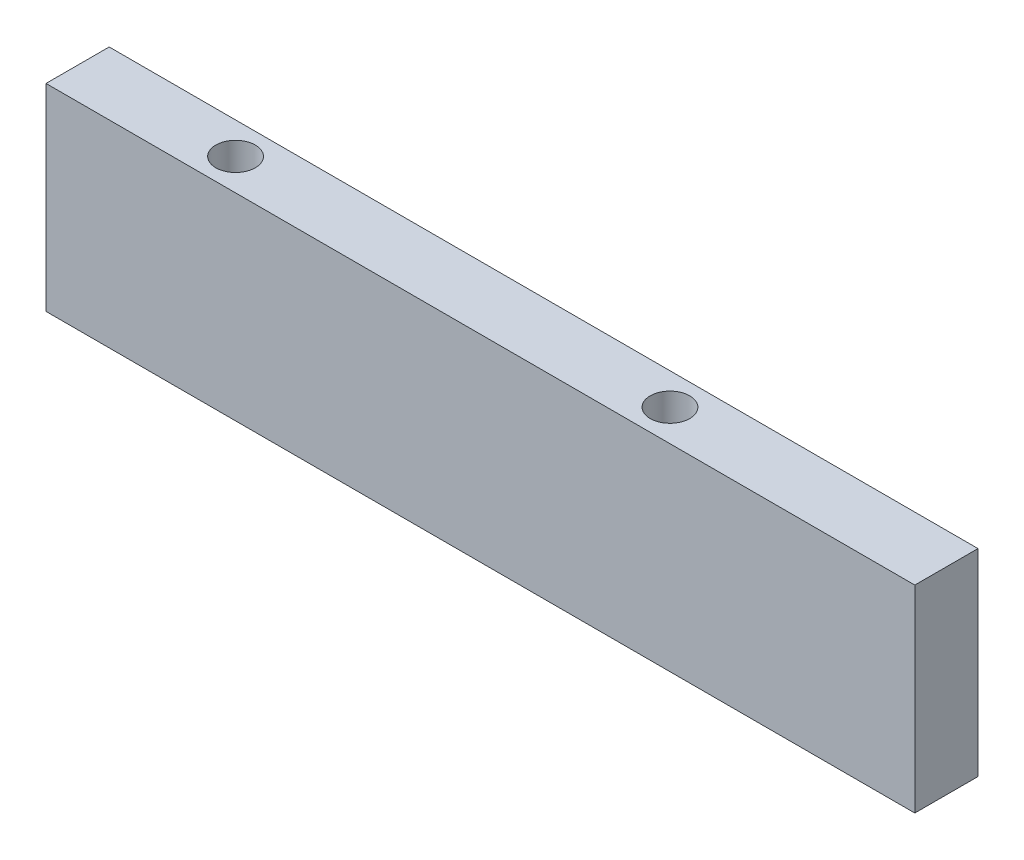
ISO-10303-21;
HEADER;
FILE_DESCRIPTION(('STEP AP214'),'2;1');
FILE_NAME('part.step','',(''),(''),'','','');
FILE_SCHEMA(('AUTOMOTIVE_DESIGN { 1 0 10303 214 1 1 1 1 }'));
ENDSEC;
DATA;
#1=APPLICATION_CONTEXT('core data for automotive mechanical design processes');
#2=APPLICATION_PROTOCOL_DEFINITION('international standard','automotive_design',2000,#1);
#3=PRODUCT_CONTEXT('',#1,'mechanical');
#4=PRODUCT('Part','Part','',(#3));
#5=PRODUCT_RELATED_PRODUCT_CATEGORY('part','',(#4));
#6=PRODUCT_DEFINITION_FORMATION('','',#4);
#7=PRODUCT_DEFINITION_CONTEXT('part definition',#1,'design');
#8=PRODUCT_DEFINITION('design','',#6,#7);
#9=PRODUCT_DEFINITION_SHAPE('','',#8);
#10=(LENGTH_UNIT() NAMED_UNIT(*) SI_UNIT(.MILLI.,.METRE.));
#11=(NAMED_UNIT(*) PLANE_ANGLE_UNIT() SI_UNIT($,.RADIAN.));
#12=(NAMED_UNIT(*) SI_UNIT($,.STERADIAN.) SOLID_ANGLE_UNIT());
#13=UNCERTAINTY_MEASURE_WITH_UNIT(LENGTH_MEASURE(1.E-05),#10,'distance_accuracy_value','');
#14=(GEOMETRIC_REPRESENTATION_CONTEXT(3) GLOBAL_UNCERTAINTY_ASSIGNED_CONTEXT((#13)) GLOBAL_UNIT_ASSIGNED_CONTEXT((#10,
#11,#12)) REPRESENTATION_CONTEXT('',''));
#15=CARTESIAN_POINT('',(0.,0.,0.));
#16=DIRECTION('',(0.,0.,1.));
#17=DIRECTION('',(1.,0.,0.));
#18=AXIS2_PLACEMENT_3D('',#15,#16,#17);
#19=CARTESIAN_POINT('',(0.,25.,0.));
#20=DIRECTION('',(1.,0.,0.));
#21=DIRECTION('',(0.,0.,-1.));
#22=AXIS2_PLACEMENT_3D('',#19,#20,#21);
#23=PLANE('',#22);
#24=DIRECTION('',(0.,0.,1.));
#25=VECTOR('',#24,1.);
#26=CARTESIAN_POINT('',(0.,0.,0.));
#27=LINE('',#26,#25);
#28=CARTESIAN_POINT('',(0.,0.,-8.));
#29=VERTEX_POINT('',#28);
#30=CARTESIAN_POINT('',(0.,0.,0.));
#31=VERTEX_POINT('',#30);
#32=EDGE_CURVE('E100',#29,#31,#27,.T.);
#33=ORIENTED_EDGE('',*,*,#32,.T.);
#34=DIRECTION('',(0.,-1.,0.));
#35=VECTOR('',#34,1.);
#36=CARTESIAN_POINT('',(0.,25.,0.));
#37=LINE('',#36,#35);
#38=CARTESIAN_POINT('',(0.,25.,0.));
#39=VERTEX_POINT('',#38);
#40=EDGE_CURVE('E11',#39,#31,#37,.T.);
#41=ORIENTED_EDGE('',*,*,#40,.F.);
#42=DIRECTION('',(0.,0.,1.));
#43=VECTOR('',#42,1.);
#44=CARTESIAN_POINT('',(0.,25.,0.));
#45=LINE('',#44,#43);
#46=CARTESIAN_POINT('',(0.,25.,-8.));
#47=VERTEX_POINT('',#46);
#48=EDGE_CURVE('E88',#47,#39,#45,.T.);
#49=ORIENTED_EDGE('',*,*,#48,.F.);
#50=DIRECTION('',(0.,-1.,0.));
#51=VECTOR('',#50,1.);
#52=CARTESIAN_POINT('',(0.,25.,-8.));
#53=LINE('',#52,#51);
#54=EDGE_CURVE('E96',#47,#29,#53,.T.);
#55=ORIENTED_EDGE('',*,*,#54,.T.);
#56=EDGE_LOOP('',(#33,#41,#49,#55));
#57=FACE_BOUND('',#56,.T.);
#58=ADVANCED_FACE('F37',(#57),#23,.F.);
#59=CARTESIAN_POINT('',(0.,25.,0.));
#60=DIRECTION('',(0.,0.,-1.));
#61=DIRECTION('',(-1.,0.,0.));
#62=AXIS2_PLACEMENT_3D('',#59,#60,#61);
#63=PLANE('',#62);
#64=DIRECTION('',(1.,0.,0.));
#65=VECTOR('',#64,1.);
#66=CARTESIAN_POINT('',(0.,0.,0.));
#67=LINE('',#66,#65);
#68=CARTESIAN_POINT('',(110.,0.,0.));
#69=VERTEX_POINT('',#68);
#70=EDGE_CURVE('E92',#31,#69,#67,.T.);
#71=ORIENTED_EDGE('',*,*,#70,.T.);
#72=DIRECTION('',(0.,-1.,0.));
#73=VECTOR('',#72,1.);
#74=CARTESIAN_POINT('',(110.,25.,0.));
#75=LINE('',#74,#73);
#76=CARTESIAN_POINT('',(110.,25.,0.));
#77=VERTEX_POINT('',#76);
#78=EDGE_CURVE('E45',#77,#69,#75,.T.);
#79=ORIENTED_EDGE('',*,*,#78,.F.);
#80=DIRECTION('',(1.,0.,0.));
#81=VECTOR('',#80,1.);
#82=CARTESIAN_POINT('',(0.,25.,0.));
#83=LINE('',#82,#81);
#84=EDGE_CURVE('E83',#39,#77,#83,.T.);
#85=ORIENTED_EDGE('',*,*,#84,.F.);
#86=ORIENTED_EDGE('',*,*,#40,.T.);
#87=EDGE_LOOP('',(#71,#79,#85,#86));
#88=FACE_BOUND('',#87,.T.);
#89=ADVANCED_FACE('F91',(#88),#63,.F.);
#90=CARTESIAN_POINT('',(110.,25.,0.));
#91=DIRECTION('',(-1.,0.,0.));
#92=DIRECTION('',(0.,0.,1.));
#93=AXIS2_PLACEMENT_3D('',#90,#91,#92);
#94=PLANE('',#93);
#95=DIRECTION('',(0.,0.,-1.));
#96=VECTOR('',#95,1.);
#97=CARTESIAN_POINT('',(110.,0.,0.));
#98=LINE('',#97,#96);
#99=CARTESIAN_POINT('',(110.,0.,-8.));
#100=VERTEX_POINT('',#99);
#101=EDGE_CURVE('E70',#69,#100,#98,.T.);
#102=ORIENTED_EDGE('',*,*,#101,.T.);
#103=DIRECTION('',(0.,-1.,0.));
#104=VECTOR('',#103,1.);
#105=CARTESIAN_POINT('',(110.,25.,-8.));
#106=LINE('',#105,#104);
#107=CARTESIAN_POINT('',(110.,25.,-8.));
#108=VERTEX_POINT('',#107);
#109=EDGE_CURVE('E93',#108,#100,#106,.T.);
#110=ORIENTED_EDGE('',*,*,#109,.F.);
#111=DIRECTION('',(0.,0.,-1.));
#112=VECTOR('',#111,1.);
#113=CARTESIAN_POINT('',(110.,25.,0.));
#114=LINE('',#113,#112);
#115=EDGE_CURVE('E86',#77,#108,#114,.T.);
#116=ORIENTED_EDGE('',*,*,#115,.F.);
#117=ORIENTED_EDGE('',*,*,#78,.T.);
#118=EDGE_LOOP('',(#102,#110,#116,#117));
#119=FACE_BOUND('',#118,.T.);
#120=ADVANCED_FACE('F94',(#119),#94,.F.);
#121=CARTESIAN_POINT('',(0.,25.,-8.));
#122=DIRECTION('',(0.,0.,1.));
#123=DIRECTION('',(1.,0.,0.));
#124=AXIS2_PLACEMENT_3D('',#121,#122,#123);
#125=PLANE('',#124);
#126=DIRECTION('',(-1.,0.,0.));
#127=VECTOR('',#126,1.);
#128=CARTESIAN_POINT('',(0.,0.,-8.));
#129=LINE('',#128,#127);
#130=EDGE_CURVE('E76',#100,#29,#129,.T.);
#131=ORIENTED_EDGE('',*,*,#130,.T.);
#132=ORIENTED_EDGE('',*,*,#54,.F.);
#133=DIRECTION('',(-1.,0.,0.));
#134=VECTOR('',#133,1.);
#135=CARTESIAN_POINT('',(0.,25.,-8.));
#136=LINE('',#135,#134);
#137=EDGE_CURVE('E53',#108,#47,#136,.T.);
#138=ORIENTED_EDGE('',*,*,#137,.F.);
#139=ORIENTED_EDGE('',*,*,#109,.T.);
#140=EDGE_LOOP('',(#131,#132,#138,#139));
#141=FACE_BOUND('',#140,.T.);
#142=ADVANCED_FACE('F108',(#141),#125,.F.);
#143=CARTESIAN_POINT('',(0.,25.,0.));
#144=DIRECTION('',(0.,-1.,0.));
#145=DIRECTION('',(0.,0.,-1.));
#146=AXIS2_PLACEMENT_3D('',#143,#144,#145);
#147=PLANE('',#146);
#148=CARTESIAN_POINT('',(20.,25.,-4.));
#149=DIRECTION('',(0.,1.,0.));
#150=DIRECTION('',(0.,0.,1.));
#151=AXIS2_PLACEMENT_3D('',#148,#149,#150);
#152=CIRCLE('',#151,2.5);
#153=CARTESIAN_POINT('',(20.,25.,-1.5));
#154=VERTEX_POINT('',#153);
#155=EDGE_CURVE('E120',#154,#154,#152,.T.);
#156=ORIENTED_EDGE('',*,*,#155,.F.);
#157=EDGE_LOOP('',(#156));
#158=FACE_BOUND('',#157,.T.);
#159=CARTESIAN_POINT('',(75.,25.,-4.));
#160=DIRECTION('',(0.,1.,0.));
#161=DIRECTION('',(0.,0.,1.));
#162=AXIS2_PLACEMENT_3D('',#159,#160,#161);
#163=CIRCLE('',#162,2.5);
#164=CARTESIAN_POINT('',(75.,25.,-1.5));
#165=VERTEX_POINT('',#164);
#166=EDGE_CURVE('E117',#165,#165,#163,.T.);
#167=ORIENTED_EDGE('',*,*,#166,.F.);
#168=EDGE_LOOP('',(#167));
#169=FACE_BOUND('',#168,.T.);
#170=ORIENTED_EDGE('',*,*,#48,.T.);
#171=ORIENTED_EDGE('',*,*,#84,.T.);
#172=ORIENTED_EDGE('',*,*,#115,.T.);
#173=ORIENTED_EDGE('',*,*,#137,.T.);
#174=EDGE_LOOP('',(#170,#171,#172,#173));
#175=FACE_BOUND('',#174,.T.);
#176=ADVANCED_FACE('F84',(#158,#169,#175),#147,.F.);
#177=CARTESIAN_POINT('',(0.,0.,0.));
#178=DIRECTION('',(0.,-1.,0.));
#179=DIRECTION('',(0.,0.,-1.));
#180=AXIS2_PLACEMENT_3D('',#177,#178,#179);
#181=PLANE('',#180);
#182=CARTESIAN_POINT('',(20.,0.,-4.));
#183=DIRECTION('',(0.,1.,0.));
#184=DIRECTION('',(0.,0.,1.));
#185=AXIS2_PLACEMENT_3D('',#182,#183,#184);
#186=CIRCLE('',#185,2.5);
#187=CARTESIAN_POINT('',(20.,0.,-1.5));
#188=VERTEX_POINT('',#187);
#189=EDGE_CURVE('E103',#188,#188,#186,.T.);
#190=ORIENTED_EDGE('',*,*,#189,.T.);
#191=EDGE_LOOP('',(#190));
#192=FACE_BOUND('',#191,.T.);
#193=CARTESIAN_POINT('',(75.,0.,-4.));
#194=DIRECTION('',(0.,1.,0.));
#195=DIRECTION('',(0.,0.,1.));
#196=AXIS2_PLACEMENT_3D('',#193,#194,#195);
#197=CIRCLE('',#196,2.5);
#198=CARTESIAN_POINT('',(75.,0.,-1.5));
#199=VERTEX_POINT('',#198);
#200=EDGE_CURVE('E114',#199,#199,#197,.T.);
#201=ORIENTED_EDGE('',*,*,#200,.T.);
#202=EDGE_LOOP('',(#201));
#203=FACE_BOUND('',#202,.T.);
#204=ORIENTED_EDGE('',*,*,#32,.F.);
#205=ORIENTED_EDGE('',*,*,#130,.F.);
#206=ORIENTED_EDGE('',*,*,#101,.F.);
#207=ORIENTED_EDGE('',*,*,#70,.F.);
#208=EDGE_LOOP('',(#204,#205,#206,#207));
#209=FACE_BOUND('',#208,.T.);
#210=ADVANCED_FACE('F111',(#192,#203,#209),#181,.T.);
#211=CARTESIAN_POINT('',(75.,0.,-4.));
#212=DIRECTION('',(0.,1.,0.));
#213=DIRECTION('',(0.,0.,1.));
#214=AXIS2_PLACEMENT_3D('',#211,#212,#213);
#215=CYLINDRICAL_SURFACE('',#214,2.5);
#216=ORIENTED_EDGE('',*,*,#200,.F.);
#217=EDGE_LOOP('',(#216));
#218=FACE_BOUND('',#217,.T.);
#219=ORIENTED_EDGE('',*,*,#166,.T.);
#220=EDGE_LOOP('',(#219));
#221=FACE_BOUND('',#220,.T.);
#222=ADVANCED_FACE('F131',(#218,#221),#215,.F.);
#223=CARTESIAN_POINT('',(20.,0.,-4.));
#224=DIRECTION('',(0.,1.,0.));
#225=DIRECTION('',(0.,0.,1.));
#226=AXIS2_PLACEMENT_3D('',#223,#224,#225);
#227=CYLINDRICAL_SURFACE('',#226,2.5);
#228=ORIENTED_EDGE('',*,*,#189,.F.);
#229=EDGE_LOOP('',(#228));
#230=FACE_BOUND('',#229,.T.);
#231=ORIENTED_EDGE('',*,*,#155,.T.);
#232=EDGE_LOOP('',(#231));
#233=FACE_BOUND('',#232,.T.);
#234=ADVANCED_FACE('F128',(#230,#233),#227,.F.);
#235=CLOSED_SHELL('',(#58,#89,#120,#142,#176,#210,#222,#234));
#236=MANIFOLD_SOLID_BREP('B2',#235);
#237=ADVANCED_BREP_SHAPE_REPRESENTATION('',(#18,#236),#14);
#238=SHAPE_DEFINITION_REPRESENTATION(#9,#237);
ENDSEC;
END-ISO-10303-21;
